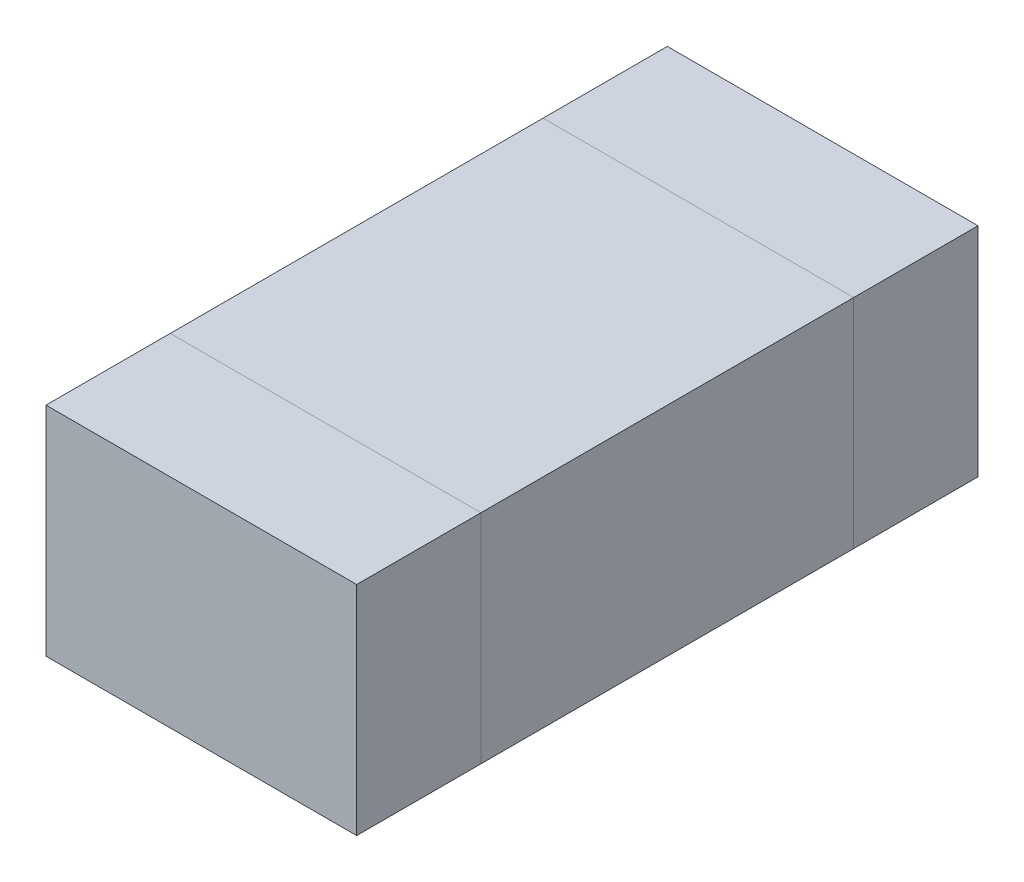
ISO-10303-21;
HEADER;
FILE_DESCRIPTION(('STEP AP214'),'2;1');
FILE_NAME('part.step','',(''),(''),'','','');
FILE_SCHEMA(('AUTOMOTIVE_DESIGN { 1 0 10303 214 1 1 1 1 }'));
ENDSEC;
DATA;
#1=APPLICATION_CONTEXT('core data for automotive mechanical design processes');
#2=APPLICATION_PROTOCOL_DEFINITION('international standard','automotive_design',2000,#1);
#3=PRODUCT_CONTEXT('',#1,'mechanical');
#4=PRODUCT('Part','Part','',(#3));
#5=PRODUCT_RELATED_PRODUCT_CATEGORY('part','',(#4));
#6=PRODUCT_DEFINITION_FORMATION('','',#4);
#7=PRODUCT_DEFINITION_CONTEXT('part definition',#1,'design');
#8=PRODUCT_DEFINITION('design','',#6,#7);
#9=PRODUCT_DEFINITION_SHAPE('','',#8);
#10=(LENGTH_UNIT() NAMED_UNIT(*) SI_UNIT(.MILLI.,.METRE.));
#11=(NAMED_UNIT(*) PLANE_ANGLE_UNIT() SI_UNIT($,.RADIAN.));
#12=(NAMED_UNIT(*) SI_UNIT($,.STERADIAN.) SOLID_ANGLE_UNIT());
#13=UNCERTAINTY_MEASURE_WITH_UNIT(LENGTH_MEASURE(1.E-05),#10,'distance_accuracy_value','');
#14=(GEOMETRIC_REPRESENTATION_CONTEXT(3) GLOBAL_UNCERTAINTY_ASSIGNED_CONTEXT((#13)) GLOBAL_UNIT_ASSIGNED_CONTEXT((#10,
#11,#12)) REPRESENTATION_CONTEXT('',''));
#15=CARTESIAN_POINT('',(0.,0.,0.));
#16=DIRECTION('',(0.,0.,1.));
#17=DIRECTION('',(1.,0.,0.));
#18=AXIS2_PLACEMENT_3D('',#15,#16,#17);
#19=CARTESIAN_POINT('',(0.,0.35,0.));
#20=DIRECTION('',(0.,1.,0.));
#21=DIRECTION('',(0.,0.,1.));
#22=AXIS2_PLACEMENT_3D('',#19,#20,#21);
#23=PLANE('',#22);
#24=DIRECTION('',(0.,0.,-1.));
#25=VECTOR('',#24,1.);
#26=CARTESIAN_POINT('',(-0.25,0.35,-0.3));
#27=LINE('',#26,#25);
#28=CARTESIAN_POINT('',(-0.25,0.35,-0.3));
#29=VERTEX_POINT('',#28);
#30=CARTESIAN_POINT('',(-0.25,0.35,-0.5));
#31=VERTEX_POINT('',#30);
#32=EDGE_CURVE('E53',#29,#31,#27,.T.);
#33=ORIENTED_EDGE('',*,*,#32,.F.);
#34=DIRECTION('',(-1.,0.,0.));
#35=VECTOR('',#34,1.);
#36=CARTESIAN_POINT('',(-0.25,0.35,-0.3));
#37=LINE('',#36,#35);
#38=CARTESIAN_POINT('',(0.25,0.35,-0.3));
#39=VERTEX_POINT('',#38);
#40=EDGE_CURVE('E76',#39,#29,#37,.T.);
#41=ORIENTED_EDGE('',*,*,#40,.F.);
#42=DIRECTION('',(0.,0.,1.));
#43=VECTOR('',#42,1.);
#44=CARTESIAN_POINT('',(0.25,0.35,-0.3));
#45=LINE('',#44,#43);
#46=CARTESIAN_POINT('',(0.25,0.35,-0.5));
#47=VERTEX_POINT('',#46);
#48=EDGE_CURVE('E81',#47,#39,#45,.T.);
#49=ORIENTED_EDGE('',*,*,#48,.F.);
#50=DIRECTION('',(1.,0.,0.));
#51=VECTOR('',#50,1.);
#52=CARTESIAN_POINT('',(-0.25,0.35,-0.5));
#53=LINE('',#52,#51);
#54=EDGE_CURVE('E96',#31,#47,#53,.T.);
#55=ORIENTED_EDGE('',*,*,#54,.F.);
#56=EDGE_LOOP('',(#33,#41,#49,#55));
#57=FACE_BOUND('',#56,.T.);
#58=ADVANCED_FACE('F45',(#57),#23,.T.);
#59=CARTESIAN_POINT('',(0.,0.,0.));
#60=DIRECTION('',(0.,-1.,0.));
#61=DIRECTION('',(0.,0.,-1.));
#62=AXIS2_PLACEMENT_3D('',#59,#60,#61);
#63=PLANE('',#62);
#64=DIRECTION('',(0.,0.,-1.));
#65=VECTOR('',#64,1.);
#66=CARTESIAN_POINT('',(-0.25,0.,-0.3));
#67=LINE('',#66,#65);
#68=CARTESIAN_POINT('',(-0.25,0.,-0.3));
#69=VERTEX_POINT('',#68);
#70=CARTESIAN_POINT('',(-0.25,0.,-0.5));
#71=VERTEX_POINT('',#70);
#72=EDGE_CURVE('E105',#69,#71,#67,.T.);
#73=ORIENTED_EDGE('',*,*,#72,.T.);
#74=DIRECTION('',(1.,0.,0.));
#75=VECTOR('',#74,1.);
#76=CARTESIAN_POINT('',(-0.25,0.,-0.5));
#77=LINE('',#76,#75);
#78=CARTESIAN_POINT('',(0.25,0.,-0.5));
#79=VERTEX_POINT('',#78);
#80=EDGE_CURVE('E94',#71,#79,#77,.T.);
#81=ORIENTED_EDGE('',*,*,#80,.T.);
#82=DIRECTION('',(0.,0.,1.));
#83=VECTOR('',#82,1.);
#84=CARTESIAN_POINT('',(0.25,0.,-0.3));
#85=LINE('',#84,#83);
#86=CARTESIAN_POINT('',(0.25,0.,-0.3));
#87=VERTEX_POINT('',#86);
#88=EDGE_CURVE('E97',#79,#87,#85,.T.);
#89=ORIENTED_EDGE('',*,*,#88,.T.);
#90=DIRECTION('',(-1.,0.,0.));
#91=VECTOR('',#90,1.);
#92=CARTESIAN_POINT('',(-0.25,0.,-0.3));
#93=LINE('',#92,#91);
#94=EDGE_CURVE('E102',#87,#69,#93,.T.);
#95=ORIENTED_EDGE('',*,*,#94,.T.);
#96=EDGE_LOOP('',(#73,#81,#89,#95));
#97=FACE_BOUND('',#96,.T.);
#98=ADVANCED_FACE('F104',(#97),#63,.T.);
#99=CARTESIAN_POINT('',(-0.25,0.888516480713451,-0.5));
#100=DIRECTION('',(0.,0.,-1.));
#101=DIRECTION('',(-1.,0.,0.));
#102=AXIS2_PLACEMENT_3D('',#99,#100,#101);
#103=PLANE('',#102);
#104=DIRECTION('',(0.,-1.,0.));
#105=VECTOR('',#104,1.);
#106=CARTESIAN_POINT('',(-0.25,0.888516480713451,-0.5));
#107=LINE('',#106,#105);
#108=EDGE_CURVE('E12',#31,#71,#107,.T.);
#109=ORIENTED_EDGE('',*,*,#108,.F.);
#110=ORIENTED_EDGE('',*,*,#54,.T.);
#111=DIRECTION('',(0.,-1.,0.));
#112=VECTOR('',#111,1.);
#113=CARTESIAN_POINT('',(0.25,0.888516480713451,-0.5));
#114=LINE('',#113,#112);
#115=EDGE_CURVE('E91',#47,#79,#114,.T.);
#116=ORIENTED_EDGE('',*,*,#115,.T.);
#117=ORIENTED_EDGE('',*,*,#80,.F.);
#118=EDGE_LOOP('',(#109,#110,#116,#117));
#119=FACE_BOUND('',#118,.T.);
#120=ADVANCED_FACE('F92',(#119),#103,.T.);
#121=CARTESIAN_POINT('',(0.25,0.888516480713451,-0.3));
#122=DIRECTION('',(1.,0.,0.));
#123=DIRECTION('',(0.,0.,-1.));
#124=AXIS2_PLACEMENT_3D('',#121,#122,#123);
#125=PLANE('',#124);
#126=ORIENTED_EDGE('',*,*,#115,.F.);
#127=ORIENTED_EDGE('',*,*,#48,.T.);
#128=DIRECTION('',(0.,-1.,0.));
#129=VECTOR('',#128,1.);
#130=CARTESIAN_POINT('',(0.25,0.888516480713451,-0.3));
#131=LINE('',#130,#129);
#132=EDGE_CURVE('E86',#39,#87,#131,.T.);
#133=ORIENTED_EDGE('',*,*,#132,.T.);
#134=ORIENTED_EDGE('',*,*,#88,.F.);
#135=EDGE_LOOP('',(#126,#127,#133,#134));
#136=FACE_BOUND('',#135,.T.);
#137=ADVANCED_FACE('F98',(#136),#125,.T.);
#138=CARTESIAN_POINT('',(-0.25,0.888516480713451,-0.3));
#139=DIRECTION('',(0.,0.,1.));
#140=DIRECTION('',(1.,0.,0.));
#141=AXIS2_PLACEMENT_3D('',#138,#139,#140);
#142=PLANE('',#141);
#143=ORIENTED_EDGE('',*,*,#132,.F.);
#144=ORIENTED_EDGE('',*,*,#40,.T.);
#145=DIRECTION('',(0.,-1.,0.));
#146=VECTOR('',#145,1.);
#147=CARTESIAN_POINT('',(-0.25,0.888516480713451,-0.3));
#148=LINE('',#147,#146);
#149=EDGE_CURVE('E112',#29,#69,#148,.T.);
#150=ORIENTED_EDGE('',*,*,#149,.T.);
#151=ORIENTED_EDGE('',*,*,#94,.F.);
#152=EDGE_LOOP('',(#143,#144,#150,#151));
#153=FACE_BOUND('',#152,.T.);
#154=ADVANCED_FACE('F118',(#153),#142,.T.);
#155=CARTESIAN_POINT('',(-0.25,0.888516480713451,-0.3));
#156=DIRECTION('',(-1.,0.,0.));
#157=DIRECTION('',(0.,0.,1.));
#158=AXIS2_PLACEMENT_3D('',#155,#156,#157);
#159=PLANE('',#158);
#160=ORIENTED_EDGE('',*,*,#149,.F.);
#161=ORIENTED_EDGE('',*,*,#32,.T.);
#162=ORIENTED_EDGE('',*,*,#108,.T.);
#163=ORIENTED_EDGE('',*,*,#72,.F.);
#164=EDGE_LOOP('',(#160,#161,#162,#163));
#165=FACE_BOUND('',#164,.T.);
#166=ADVANCED_FACE('F119',(#165),#159,.T.);
#167=CLOSED_SHELL('',(#58,#98,#120,#137,#154,#166));
#168=MANIFOLD_SOLID_BREP('B2',#167);
#169=CARTESIAN_POINT('',(0.,0.35,0.));
#170=DIRECTION('',(0.,1.,0.));
#171=DIRECTION('',(0.,0.,1.));
#172=AXIS2_PLACEMENT_3D('',#169,#170,#171);
#173=PLANE('',#172);
#174=DIRECTION('',(0.,0.,-1.));
#175=VECTOR('',#174,1.);
#176=CARTESIAN_POINT('',(-0.25,0.35,0.3));
#177=LINE('',#176,#175);
#178=CARTESIAN_POINT('',(-0.25,0.35,0.5));
#179=VERTEX_POINT('',#178);
#180=CARTESIAN_POINT('',(-0.25,0.35,0.3));
#181=VERTEX_POINT('',#180);
#182=EDGE_CURVE('E185',#179,#181,#177,.T.);
#183=ORIENTED_EDGE('',*,*,#182,.F.);
#184=DIRECTION('',(-1.,0.,0.));
#185=VECTOR('',#184,1.);
#186=CARTESIAN_POINT('',(-0.25,0.35,0.5));
#187=LINE('',#186,#185);
#188=CARTESIAN_POINT('',(0.25,0.35,0.5));
#189=VERTEX_POINT('',#188);
#190=EDGE_CURVE('E208',#189,#179,#187,.T.);
#191=ORIENTED_EDGE('',*,*,#190,.F.);
#192=DIRECTION('',(0.,0.,1.));
#193=VECTOR('',#192,1.);
#194=CARTESIAN_POINT('',(0.25,0.35,0.3));
#195=LINE('',#194,#193);
#196=CARTESIAN_POINT('',(0.25,0.35,0.3));
#197=VERTEX_POINT('',#196);
#198=EDGE_CURVE('E213',#197,#189,#195,.T.);
#199=ORIENTED_EDGE('',*,*,#198,.F.);
#200=DIRECTION('',(1.,0.,0.));
#201=VECTOR('',#200,1.);
#202=CARTESIAN_POINT('',(-0.25,0.35,0.3));
#203=LINE('',#202,#201);
#204=EDGE_CURVE('E228',#181,#197,#203,.T.);
#205=ORIENTED_EDGE('',*,*,#204,.F.);
#206=EDGE_LOOP('',(#183,#191,#199,#205));
#207=FACE_BOUND('',#206,.T.);
#208=ADVANCED_FACE('F177',(#207),#173,.T.);
#209=CARTESIAN_POINT('',(0.,0.,0.));
#210=DIRECTION('',(0.,1.,0.));
#211=DIRECTION('',(0.,0.,1.));
#212=AXIS2_PLACEMENT_3D('',#209,#210,#211);
#213=PLANE('',#212);
#214=DIRECTION('',(0.,0.,-1.));
#215=VECTOR('',#214,1.);
#216=CARTESIAN_POINT('',(-0.25,0.,0.3));
#217=LINE('',#216,#215);
#218=CARTESIAN_POINT('',(-0.25,0.,0.5));
#219=VERTEX_POINT('',#218);
#220=CARTESIAN_POINT('',(-0.25,0.,0.3));
#221=VERTEX_POINT('',#220);
#222=EDGE_CURVE('E237',#219,#221,#217,.T.);
#223=ORIENTED_EDGE('',*,*,#222,.T.);
#224=DIRECTION('',(1.,0.,0.));
#225=VECTOR('',#224,1.);
#226=CARTESIAN_POINT('',(-0.25,0.,0.3));
#227=LINE('',#226,#225);
#228=CARTESIAN_POINT('',(0.25,0.,0.3));
#229=VERTEX_POINT('',#228);
#230=EDGE_CURVE('E226',#221,#229,#227,.T.);
#231=ORIENTED_EDGE('',*,*,#230,.T.);
#232=DIRECTION('',(0.,0.,1.));
#233=VECTOR('',#232,1.);
#234=CARTESIAN_POINT('',(0.25,0.,0.3));
#235=LINE('',#234,#233);
#236=CARTESIAN_POINT('',(0.25,0.,0.5));
#237=VERTEX_POINT('',#236);
#238=EDGE_CURVE('E229',#229,#237,#235,.T.);
#239=ORIENTED_EDGE('',*,*,#238,.T.);
#240=DIRECTION('',(-1.,0.,0.));
#241=VECTOR('',#240,1.);
#242=CARTESIAN_POINT('',(-0.25,0.,0.5));
#243=LINE('',#242,#241);
#244=EDGE_CURVE('E234',#237,#219,#243,.T.);
#245=ORIENTED_EDGE('',*,*,#244,.T.);
#246=EDGE_LOOP('',(#223,#231,#239,#245));
#247=FACE_BOUND('',#246,.T.);
#248=ADVANCED_FACE('F236',(#247),#213,.F.);
#249=CARTESIAN_POINT('',(-0.25,0.88851648071345,0.3));
#250=DIRECTION('',(0.,0.,-1.));
#251=DIRECTION('',(-1.,0.,0.));
#252=AXIS2_PLACEMENT_3D('',#249,#250,#251);
#253=PLANE('',#252);
#254=DIRECTION('',(0.,-1.,0.));
#255=VECTOR('',#254,1.);
#256=CARTESIAN_POINT('',(-0.25,0.88851648071345,0.3));
#257=LINE('',#256,#255);
#258=EDGE_CURVE('E43',#181,#221,#257,.T.);
#259=ORIENTED_EDGE('',*,*,#258,.F.);
#260=ORIENTED_EDGE('',*,*,#204,.T.);
#261=DIRECTION('',(0.,-1.,0.));
#262=VECTOR('',#261,1.);
#263=CARTESIAN_POINT('',(0.25,0.88851648071345,0.3));
#264=LINE('',#263,#262);
#265=EDGE_CURVE('E223',#197,#229,#264,.T.);
#266=ORIENTED_EDGE('',*,*,#265,.T.);
#267=ORIENTED_EDGE('',*,*,#230,.F.);
#268=EDGE_LOOP('',(#259,#260,#266,#267));
#269=FACE_BOUND('',#268,.T.);
#270=ADVANCED_FACE('F224',(#269),#253,.T.);
#271=CARTESIAN_POINT('',(0.25,0.88851648071345,0.3));
#272=DIRECTION('',(1.,0.,0.));
#273=DIRECTION('',(0.,0.,-1.));
#274=AXIS2_PLACEMENT_3D('',#271,#272,#273);
#275=PLANE('',#274);
#276=ORIENTED_EDGE('',*,*,#265,.F.);
#277=ORIENTED_EDGE('',*,*,#198,.T.);
#278=DIRECTION('',(0.,-1.,0.));
#279=VECTOR('',#278,1.);
#280=CARTESIAN_POINT('',(0.25,0.88851648071345,0.5));
#281=LINE('',#280,#279);
#282=EDGE_CURVE('E218',#189,#237,#281,.T.);
#283=ORIENTED_EDGE('',*,*,#282,.T.);
#284=ORIENTED_EDGE('',*,*,#238,.F.);
#285=EDGE_LOOP('',(#276,#277,#283,#284));
#286=FACE_BOUND('',#285,.T.);
#287=ADVANCED_FACE('F230',(#286),#275,.T.);
#288=CARTESIAN_POINT('',(-0.25,0.88851648071345,0.5));
#289=DIRECTION('',(0.,0.,1.));
#290=DIRECTION('',(1.,0.,0.));
#291=AXIS2_PLACEMENT_3D('',#288,#289,#290);
#292=PLANE('',#291);
#293=ORIENTED_EDGE('',*,*,#282,.F.);
#294=ORIENTED_EDGE('',*,*,#190,.T.);
#295=DIRECTION('',(0.,-1.,0.));
#296=VECTOR('',#295,1.);
#297=CARTESIAN_POINT('',(-0.25,0.88851648071345,0.5));
#298=LINE('',#297,#296);
#299=EDGE_CURVE('E244',#179,#219,#298,.T.);
#300=ORIENTED_EDGE('',*,*,#299,.T.);
#301=ORIENTED_EDGE('',*,*,#244,.F.);
#302=EDGE_LOOP('',(#293,#294,#300,#301));
#303=FACE_BOUND('',#302,.T.);
#304=ADVANCED_FACE('F250',(#303),#292,.T.);
#305=CARTESIAN_POINT('',(-0.25,0.88851648071345,0.3));
#306=DIRECTION('',(-1.,0.,0.));
#307=DIRECTION('',(0.,0.,1.));
#308=AXIS2_PLACEMENT_3D('',#305,#306,#307);
#309=PLANE('',#308);
#310=ORIENTED_EDGE('',*,*,#299,.F.);
#311=ORIENTED_EDGE('',*,*,#182,.T.);
#312=ORIENTED_EDGE('',*,*,#258,.T.);
#313=ORIENTED_EDGE('',*,*,#222,.F.);
#314=EDGE_LOOP('',(#310,#311,#312,#313));
#315=FACE_BOUND('',#314,.T.);
#316=ADVANCED_FACE('F251',(#315),#309,.T.);
#317=CLOSED_SHELL('',(#208,#248,#270,#287,#304,#316));
#318=MANIFOLD_SOLID_BREP('B6',#317);
#319=CARTESIAN_POINT('',(0.25,0.35,-0.3));
#320=DIRECTION('',(-1.,0.,0.));
#321=DIRECTION('',(0.,0.,1.));
#322=AXIS2_PLACEMENT_3D('',#319,#320,#321);
#323=PLANE('',#322);
#324=DIRECTION('',(0.,0.,-1.));
#325=VECTOR('',#324,1.);
#326=CARTESIAN_POINT('',(0.25,0.,-0.3));
#327=LINE('',#326,#325);
#328=CARTESIAN_POINT('',(0.25,0.,0.3));
#329=VERTEX_POINT('',#328);
#330=CARTESIAN_POINT('',(0.25,0.,-0.3));
#331=VERTEX_POINT('',#330);
#332=EDGE_CURVE('E363',#329,#331,#327,.T.);
#333=ORIENTED_EDGE('',*,*,#332,.T.);
#334=DIRECTION('',(0.,-1.,0.));
#335=VECTOR('',#334,1.);
#336=CARTESIAN_POINT('',(0.25,0.35,-0.3));
#337=LINE('',#336,#335);
#338=CARTESIAN_POINT('',(0.25,0.35,-0.3));
#339=VERTEX_POINT('',#338);
#340=EDGE_CURVE('E175',#339,#331,#337,.T.);
#341=ORIENTED_EDGE('',*,*,#340,.F.);
#342=DIRECTION('',(0.,0.,-1.));
#343=VECTOR('',#342,1.);
#344=CARTESIAN_POINT('',(0.25,0.35,-0.3));
#345=LINE('',#344,#343);
#346=CARTESIAN_POINT('',(0.25,0.35,0.3));
#347=VERTEX_POINT('',#346);
#348=EDGE_CURVE('E351',#347,#339,#345,.T.);
#349=ORIENTED_EDGE('',*,*,#348,.F.);
#350=DIRECTION('',(0.,-1.,0.));
#351=VECTOR('',#350,1.);
#352=CARTESIAN_POINT('',(0.25,0.35,0.3));
#353=LINE('',#352,#351);
#354=EDGE_CURVE('E359',#347,#329,#353,.T.);
#355=ORIENTED_EDGE('',*,*,#354,.T.);
#356=EDGE_LOOP('',(#333,#341,#349,#355));
#357=FACE_BOUND('',#356,.T.);
#358=ADVANCED_FACE('F300',(#357),#323,.F.);
#359=CARTESIAN_POINT('',(-0.25,0.35,-0.3));
#360=DIRECTION('',(0.,0.,1.));
#361=DIRECTION('',(1.,0.,0.));
#362=AXIS2_PLACEMENT_3D('',#359,#360,#361);
#363=PLANE('',#362);
#364=DIRECTION('',(-1.,0.,0.));
#365=VECTOR('',#364,1.);
#366=CARTESIAN_POINT('',(-0.25,0.,-0.3));
#367=LINE('',#366,#365);
#368=CARTESIAN_POINT('',(-0.25,0.,-0.3));
#369=VERTEX_POINT('',#368);
#370=EDGE_CURVE('E355',#331,#369,#367,.T.);
#371=ORIENTED_EDGE('',*,*,#370,.T.);
#372=DIRECTION('',(0.,-1.,0.));
#373=VECTOR('',#372,1.);
#374=CARTESIAN_POINT('',(-0.25,0.35,-0.3));
#375=LINE('',#374,#373);
#376=CARTESIAN_POINT('',(-0.25,0.35,-0.3));
#377=VERTEX_POINT('',#376);
#378=EDGE_CURVE('E308',#377,#369,#375,.T.);
#379=ORIENTED_EDGE('',*,*,#378,.F.);
#380=DIRECTION('',(-1.,0.,0.));
#381=VECTOR('',#380,1.);
#382=CARTESIAN_POINT('',(-0.25,0.35,-0.3));
#383=LINE('',#382,#381);
#384=EDGE_CURVE('E346',#339,#377,#383,.T.);
#385=ORIENTED_EDGE('',*,*,#384,.F.);
#386=ORIENTED_EDGE('',*,*,#340,.T.);
#387=EDGE_LOOP('',(#371,#379,#385,#386));
#388=FACE_BOUND('',#387,.T.);
#389=ADVANCED_FACE('F354',(#388),#363,.F.);
#390=CARTESIAN_POINT('',(-0.25,0.35,-0.3));
#391=DIRECTION('',(1.,0.,0.));
#392=DIRECTION('',(0.,0.,-1.));
#393=AXIS2_PLACEMENT_3D('',#390,#391,#392);
#394=PLANE('',#393);
#395=DIRECTION('',(0.,0.,1.));
#396=VECTOR('',#395,1.);
#397=CARTESIAN_POINT('',(-0.25,0.,-0.3));
#398=LINE('',#397,#396);
#399=CARTESIAN_POINT('',(-0.25,0.,0.3));
#400=VERTEX_POINT('',#399);
#401=EDGE_CURVE('E333',#369,#400,#398,.T.);
#402=ORIENTED_EDGE('',*,*,#401,.T.);
#403=DIRECTION('',(0.,-1.,0.));
#404=VECTOR('',#403,1.);
#405=CARTESIAN_POINT('',(-0.25,0.35,0.3));
#406=LINE('',#405,#404);
#407=CARTESIAN_POINT('',(-0.25,0.35,0.3));
#408=VERTEX_POINT('',#407);
#409=EDGE_CURVE('E356',#408,#400,#406,.T.);
#410=ORIENTED_EDGE('',*,*,#409,.F.);
#411=DIRECTION('',(0.,0.,1.));
#412=VECTOR('',#411,1.);
#413=CARTESIAN_POINT('',(-0.25,0.35,-0.3));
#414=LINE('',#413,#412);
#415=EDGE_CURVE('E349',#377,#408,#414,.T.);
#416=ORIENTED_EDGE('',*,*,#415,.F.);
#417=ORIENTED_EDGE('',*,*,#378,.T.);
#418=EDGE_LOOP('',(#402,#410,#416,#417));
#419=FACE_BOUND('',#418,.T.);
#420=ADVANCED_FACE('F357',(#419),#394,.F.);
#421=CARTESIAN_POINT('',(-0.25,0.35,0.3));
#422=DIRECTION('',(0.,0.,-1.));
#423=DIRECTION('',(-1.,0.,0.));
#424=AXIS2_PLACEMENT_3D('',#421,#422,#423);
#425=PLANE('',#424);
#426=DIRECTION('',(1.,0.,0.));
#427=VECTOR('',#426,1.);
#428=CARTESIAN_POINT('',(-0.25,0.,0.3));
#429=LINE('',#428,#427);
#430=EDGE_CURVE('E339',#400,#329,#429,.T.);
#431=ORIENTED_EDGE('',*,*,#430,.T.);
#432=ORIENTED_EDGE('',*,*,#354,.F.);
#433=DIRECTION('',(1.,0.,0.));
#434=VECTOR('',#433,1.);
#435=CARTESIAN_POINT('',(-0.25,0.35,0.3));
#436=LINE('',#435,#434);
#437=EDGE_CURVE('E316',#408,#347,#436,.T.);
#438=ORIENTED_EDGE('',*,*,#437,.F.);
#439=ORIENTED_EDGE('',*,*,#409,.T.);
#440=EDGE_LOOP('',(#431,#432,#438,#439));
#441=FACE_BOUND('',#440,.T.);
#442=ADVANCED_FACE('F370',(#441),#425,.F.);
#443=CARTESIAN_POINT('',(0.,0.35,0.));
#444=DIRECTION('',(0.,1.,0.));
#445=DIRECTION('',(0.,0.,1.));
#446=AXIS2_PLACEMENT_3D('',#443,#444,#445);
#447=PLANE('',#446);
#448=ORIENTED_EDGE('',*,*,#348,.T.);
#449=ORIENTED_EDGE('',*,*,#384,.T.);
#450=ORIENTED_EDGE('',*,*,#415,.T.);
#451=ORIENTED_EDGE('',*,*,#437,.T.);
#452=EDGE_LOOP('',(#448,#449,#450,#451));
#453=FACE_BOUND('',#452,.T.);
#454=ADVANCED_FACE('F347',(#453),#447,.T.);
#455=CARTESIAN_POINT('',(0.,0.,0.));
#456=DIRECTION('',(0.,1.,0.));
#457=DIRECTION('',(0.,0.,1.));
#458=AXIS2_PLACEMENT_3D('',#455,#456,#457);
#459=PLANE('',#458);
#460=ORIENTED_EDGE('',*,*,#332,.F.);
#461=ORIENTED_EDGE('',*,*,#430,.F.);
#462=ORIENTED_EDGE('',*,*,#401,.F.);
#463=ORIENTED_EDGE('',*,*,#370,.F.);
#464=EDGE_LOOP('',(#460,#461,#462,#463));
#465=FACE_BOUND('',#464,.T.);
#466=ADVANCED_FACE('F373',(#465),#459,.F.);
#467=CLOSED_SHELL('',(#358,#389,#420,#442,#454,#466));
#468=MANIFOLD_SOLID_BREP('B37',#467);
#469=ADVANCED_BREP_SHAPE_REPRESENTATION('',(#18,#168,#318,#468),#14);
#470=SHAPE_DEFINITION_REPRESENTATION(#9,#469);
ENDSEC;
END-ISO-10303-21;
